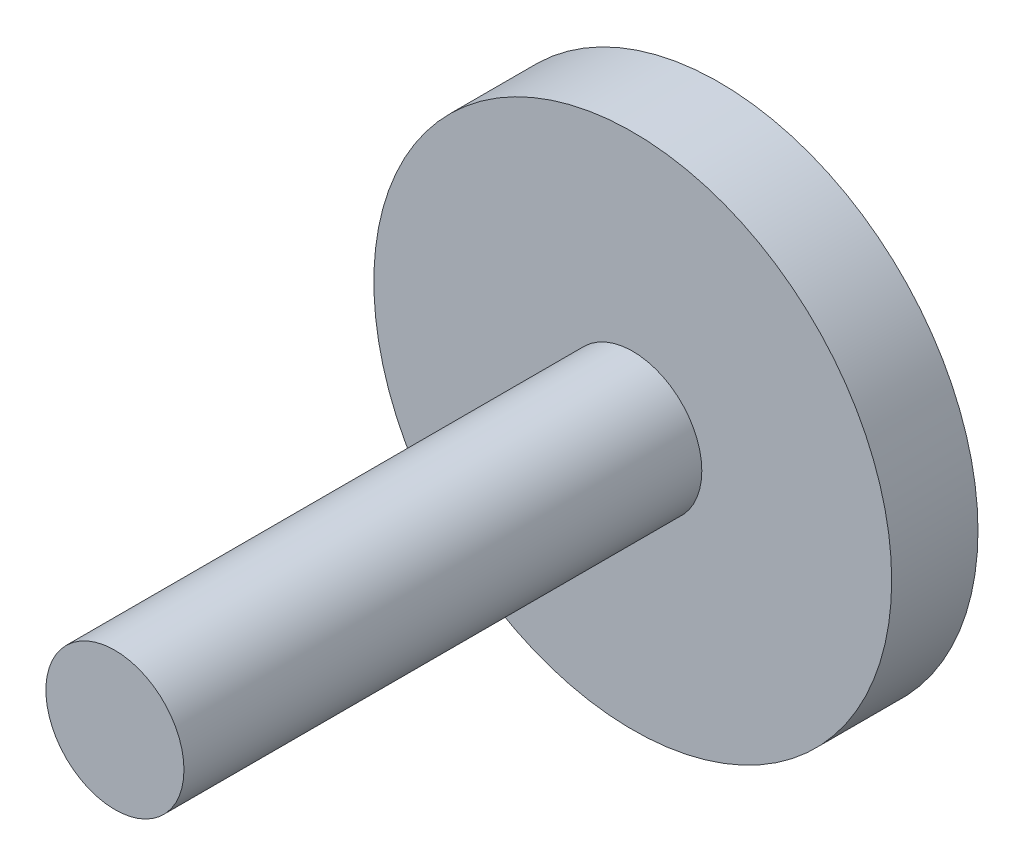
ISO-10303-21;
HEADER;
FILE_DESCRIPTION(('STEP AP214'),'2;1');
FILE_NAME('part.step','',(''),(''),'','','');
FILE_SCHEMA(('AUTOMOTIVE_DESIGN { 1 0 10303 214 1 1 1 1 }'));
ENDSEC;
DATA;
#1=APPLICATION_CONTEXT('core data for automotive mechanical design processes');
#2=APPLICATION_PROTOCOL_DEFINITION('international standard','automotive_design',2000,#1);
#3=PRODUCT_CONTEXT('',#1,'mechanical');
#4=PRODUCT('Part','Part','',(#3));
#5=PRODUCT_RELATED_PRODUCT_CATEGORY('part','',(#4));
#6=PRODUCT_DEFINITION_FORMATION('','',#4);
#7=PRODUCT_DEFINITION_CONTEXT('part definition',#1,'design');
#8=PRODUCT_DEFINITION('design','',#6,#7);
#9=PRODUCT_DEFINITION_SHAPE('','',#8);
#10=(LENGTH_UNIT() NAMED_UNIT(*) SI_UNIT(.MILLI.,.METRE.));
#11=(NAMED_UNIT(*) PLANE_ANGLE_UNIT() SI_UNIT($,.RADIAN.));
#12=(NAMED_UNIT(*) SI_UNIT($,.STERADIAN.) SOLID_ANGLE_UNIT());
#13=UNCERTAINTY_MEASURE_WITH_UNIT(LENGTH_MEASURE(1.E-05),#10,'distance_accuracy_value','');
#14=(GEOMETRIC_REPRESENTATION_CONTEXT(3) GLOBAL_UNCERTAINTY_ASSIGNED_CONTEXT((#13)) GLOBAL_UNIT_ASSIGNED_CONTEXT((#10,
#11,#12)) REPRESENTATION_CONTEXT('',''));
#15=CARTESIAN_POINT('',(0.,0.,0.));
#16=DIRECTION('',(0.,0.,1.));
#17=DIRECTION('',(1.,0.,0.));
#18=AXIS2_PLACEMENT_3D('',#15,#16,#17);
#19=CARTESIAN_POINT('',(0.,0.,5.));
#20=DIRECTION('',(0.,0.,-1.));
#21=DIRECTION('',(-1.,0.,0.));
#22=AXIS2_PLACEMENT_3D('',#19,#20,#21);
#23=CYLINDRICAL_SURFACE('',#22,15.);
#24=CARTESIAN_POINT('',(0.,0.,5.));
#25=DIRECTION('',(0.,0.,1.));
#26=DIRECTION('',(1.,0.,0.));
#27=AXIS2_PLACEMENT_3D('',#24,#25,#26);
#28=CIRCLE('',#27,15.);
#29=CARTESIAN_POINT('',(15.,0.,5.));
#30=VERTEX_POINT('',#29);
#31=EDGE_CURVE('E37',#30,#30,#28,.T.);
#32=ORIENTED_EDGE('',*,*,#31,.F.);
#33=EDGE_LOOP('',(#32));
#34=FACE_BOUND('',#33,.T.);
#35=CARTESIAN_POINT('',(0.,0.,0.));
#36=DIRECTION('',(0.,0.,1.));
#37=DIRECTION('',(1.,0.,0.));
#38=AXIS2_PLACEMENT_3D('',#35,#36,#37);
#39=CIRCLE('',#38,15.);
#40=CARTESIAN_POINT('',(15.,0.,0.));
#41=VERTEX_POINT('',#40);
#42=EDGE_CURVE('E33',#41,#41,#39,.T.);
#43=ORIENTED_EDGE('',*,*,#42,.T.);
#44=EDGE_LOOP('',(#43));
#45=FACE_BOUND('',#44,.T.);
#46=ADVANCED_FACE('F30',(#34,#45),#23,.T.);
#47=CARTESIAN_POINT('',(0.,0.,5.));
#48=DIRECTION('',(0.,0.,1.));
#49=DIRECTION('',(1.,0.,0.));
#50=AXIS2_PLACEMENT_3D('',#47,#48,#49);
#51=PLANE('',#50);
#52=CARTESIAN_POINT('',(0.,0.,5.));
#53=DIRECTION('',(0.,0.,1.));
#54=DIRECTION('',(1.,0.,0.));
#55=AXIS2_PLACEMENT_3D('',#52,#53,#54);
#56=CIRCLE('',#55,4.);
#57=CARTESIAN_POINT('',(4.,0.,5.));
#58=VERTEX_POINT('',#57);
#59=EDGE_CURVE('E10',#58,#58,#56,.T.);
#60=ORIENTED_EDGE('',*,*,#59,.F.);
#61=EDGE_LOOP('',(#60));
#62=FACE_BOUND('',#61,.T.);
#63=ORIENTED_EDGE('',*,*,#31,.T.);
#64=EDGE_LOOP('',(#63));
#65=FACE_BOUND('',#64,.T.);
#66=ADVANCED_FACE('F54',(#62,#65),#51,.T.);
#67=CARTESIAN_POINT('',(0.,0.,0.));
#68=DIRECTION('',(0.,0.,1.));
#69=DIRECTION('',(1.,0.,0.));
#70=AXIS2_PLACEMENT_3D('',#67,#68,#69);
#71=PLANE('',#70);
#72=ORIENTED_EDGE('',*,*,#42,.F.);
#73=EDGE_LOOP('',(#72));
#74=FACE_BOUND('',#73,.T.);
#75=ADVANCED_FACE('F51',(#74),#71,.F.);
#76=CARTESIAN_POINT('',(0.,0.,35.));
#77=DIRECTION('',(0.,0.,-1.));
#78=DIRECTION('',(-1.,0.,0.));
#79=AXIS2_PLACEMENT_3D('',#76,#77,#78);
#80=CYLINDRICAL_SURFACE('',#79,4.);
#81=CARTESIAN_POINT('',(0.,0.,35.));
#82=DIRECTION('',(0.,0.,1.));
#83=DIRECTION('',(1.,0.,0.));
#84=AXIS2_PLACEMENT_3D('',#81,#82,#83);
#85=CIRCLE('',#84,4.);
#86=CARTESIAN_POINT('',(4.,0.,35.));
#87=VERTEX_POINT('',#86);
#88=EDGE_CURVE('E43',#87,#87,#85,.T.);
#89=ORIENTED_EDGE('',*,*,#88,.F.);
#90=EDGE_LOOP('',(#89));
#91=FACE_BOUND('',#90,.T.);
#92=ORIENTED_EDGE('',*,*,#59,.T.);
#93=EDGE_LOOP('',(#92));
#94=FACE_BOUND('',#93,.T.);
#95=ADVANCED_FACE('F53',(#91,#94),#80,.T.);
#96=CARTESIAN_POINT('',(0.,0.,35.));
#97=DIRECTION('',(0.,0.,1.));
#98=DIRECTION('',(1.,0.,0.));
#99=AXIS2_PLACEMENT_3D('',#96,#97,#98);
#100=PLANE('',#99);
#101=ORIENTED_EDGE('',*,*,#88,.T.);
#102=EDGE_LOOP('',(#101));
#103=FACE_BOUND('',#102,.T.);
#104=ADVANCED_FACE('F59',(#103),#100,.T.);
#105=CLOSED_SHELL('',(#46,#66,#75,#95,#104));
#106=MANIFOLD_SOLID_BREP('B2',#105);
#107=ADVANCED_BREP_SHAPE_REPRESENTATION('',(#18,#106),#14);
#108=SHAPE_DEFINITION_REPRESENTATION(#9,#107);
ENDSEC;
END-ISO-10303-21;
